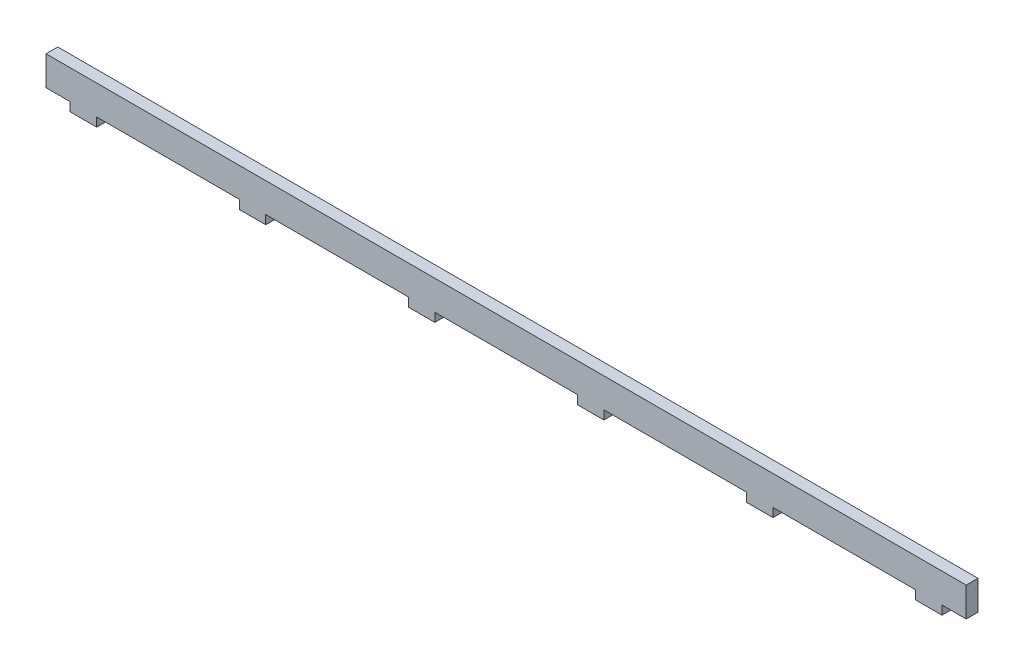
ISO-10303-21;
HEADER;
FILE_DESCRIPTION(('STEP AP214'),'2;1');
FILE_NAME('part.step','',(''),(''),'','','');
FILE_SCHEMA(('AUTOMOTIVE_DESIGN { 1 0 10303 214 1 1 1 1 }'));
ENDSEC;
DATA;
#1=APPLICATION_CONTEXT('core data for automotive mechanical design processes');
#2=APPLICATION_PROTOCOL_DEFINITION('international standard','automotive_design',2000,#1);
#3=PRODUCT_CONTEXT('',#1,'mechanical');
#4=PRODUCT('Part','Part','',(#3));
#5=PRODUCT_RELATED_PRODUCT_CATEGORY('part','',(#4));
#6=PRODUCT_DEFINITION_FORMATION('','',#4);
#7=PRODUCT_DEFINITION_CONTEXT('part definition',#1,'design');
#8=PRODUCT_DEFINITION('design','',#6,#7);
#9=PRODUCT_DEFINITION_SHAPE('','',#8);
#10=(LENGTH_UNIT() NAMED_UNIT(*) SI_UNIT(.MILLI.,.METRE.));
#11=(NAMED_UNIT(*) PLANE_ANGLE_UNIT() SI_UNIT($,.RADIAN.));
#12=(NAMED_UNIT(*) SI_UNIT($,.STERADIAN.) SOLID_ANGLE_UNIT());
#13=UNCERTAINTY_MEASURE_WITH_UNIT(LENGTH_MEASURE(1.E-05),#10,'distance_accuracy_value','');
#14=(GEOMETRIC_REPRESENTATION_CONTEXT(3) GLOBAL_UNCERTAINTY_ASSIGNED_CONTEXT((#13)) GLOBAL_UNIT_ASSIGNED_CONTEXT((#10,
#11,#12)) REPRESENTATION_CONTEXT('',''));
#15=CARTESIAN_POINT('',(0.,0.,0.));
#16=DIRECTION('',(0.,0.,1.));
#17=DIRECTION('',(1.,0.,0.));
#18=AXIS2_PLACEMENT_3D('',#15,#16,#17);
#19=CARTESIAN_POINT('',(-148.2634,-206.5,13.));
#20=DIRECTION('',(-1.,0.,0.));
#21=DIRECTION('',(0.,1.,0.));
#22=AXIS2_PLACEMENT_3D('',#19,#20,#21);
#23=PLANE('',#22);
#24=DIRECTION('',(0.,0.,1.));
#25=VECTOR('',#24,1.);
#26=CARTESIAN_POINT('',(-148.2634,-203.5,13.));
#27=LINE('',#26,#25);
#28=CARTESIAN_POINT('',(-148.2634,-203.5,8.99999999999999));
#29=VERTEX_POINT('',#28);
#30=CARTESIAN_POINT('',(-148.2634,-203.5,13.));
#31=VERTEX_POINT('',#30);
#32=EDGE_CURVE('E11',#29,#31,#27,.T.);
#33=ORIENTED_EDGE('',*,*,#32,.F.);
#34=DIRECTION('',(0.,1.,0.));
#35=VECTOR('',#34,1.);
#36=CARTESIAN_POINT('',(-148.2634,0.,8.99999999999999));
#37=LINE('',#36,#35);
#38=CARTESIAN_POINT('',(-148.2634,-206.5,8.99999999999999));
#39=VERTEX_POINT('',#38);
#40=EDGE_CURVE('E166',#39,#29,#37,.T.);
#41=ORIENTED_EDGE('',*,*,#40,.F.);
#42=DIRECTION('',(0.,0.,1.));
#43=VECTOR('',#42,1.);
#44=CARTESIAN_POINT('',(-148.2634,-206.5,13.));
#45=LINE('',#44,#43);
#46=CARTESIAN_POINT('',(-148.2634,-206.5,13.));
#47=VERTEX_POINT('',#46);
#48=EDGE_CURVE('E48',#39,#47,#45,.T.);
#49=ORIENTED_EDGE('',*,*,#48,.T.);
#50=DIRECTION('',(0.,1.,0.));
#51=VECTOR('',#50,1.);
#52=CARTESIAN_POINT('',(-148.2634,-206.5,13.));
#53=LINE('',#52,#51);
#54=EDGE_CURVE('E324',#47,#31,#53,.T.);
#55=ORIENTED_EDGE('',*,*,#54,.T.);
#56=EDGE_LOOP('',(#33,#41,#49,#55));
#57=FACE_BOUND('',#56,.T.);
#58=ADVANCED_FACE('F39',(#57),#23,.T.);
#59=CARTESIAN_POINT('',(-139.2634,-206.5,13.));
#60=DIRECTION('',(0.,-1.,0.));
#61=DIRECTION('',(-1.,0.,0.));
#62=AXIS2_PLACEMENT_3D('',#59,#60,#61);
#63=PLANE('',#62);
#64=ORIENTED_EDGE('',*,*,#48,.F.);
#65=DIRECTION('',(-1.,0.,0.));
#66=VECTOR('',#65,1.);
#67=CARTESIAN_POINT('',(0.,-206.5,8.99999999999999));
#68=LINE('',#67,#66);
#69=CARTESIAN_POINT('',(-139.2634,-206.5,8.99999999999999));
#70=VERTEX_POINT('',#69);
#71=EDGE_CURVE('E245',#70,#39,#68,.T.);
#72=ORIENTED_EDGE('',*,*,#71,.F.);
#73=DIRECTION('',(0.,0.,1.));
#74=VECTOR('',#73,1.);
#75=CARTESIAN_POINT('',(-139.2634,-206.5,13.));
#76=LINE('',#75,#74);
#77=CARTESIAN_POINT('',(-139.2634,-206.5,13.));
#78=VERTEX_POINT('',#77);
#79=EDGE_CURVE('E317',#70,#78,#76,.T.);
#80=ORIENTED_EDGE('',*,*,#79,.T.);
#81=DIRECTION('',(-1.,0.,0.));
#82=VECTOR('',#81,1.);
#83=CARTESIAN_POINT('',(-139.2634,-206.5,13.));
#84=LINE('',#83,#82);
#85=EDGE_CURVE('E334',#78,#47,#84,.T.);
#86=ORIENTED_EDGE('',*,*,#85,.T.);
#87=EDGE_LOOP('',(#64,#72,#80,#86));
#88=FACE_BOUND('',#87,.T.);
#89=ADVANCED_FACE('F337',(#88),#63,.T.);
#90=CARTESIAN_POINT('',(-139.2634,-206.5,13.));
#91=DIRECTION('',(-1.,0.,0.));
#92=DIRECTION('',(0.,1.,0.));
#93=AXIS2_PLACEMENT_3D('',#90,#91,#92);
#94=PLANE('',#93);
#95=ORIENTED_EDGE('',*,*,#79,.F.);
#96=DIRECTION('',(0.,1.,0.));
#97=VECTOR('',#96,1.);
#98=CARTESIAN_POINT('',(-139.2634,0.,8.99999999999999));
#99=LINE('',#98,#97);
#100=CARTESIAN_POINT('',(-139.2634,-203.5,8.99999999999999));
#101=VERTEX_POINT('',#100);
#102=EDGE_CURVE('E242',#70,#101,#99,.T.);
#103=ORIENTED_EDGE('',*,*,#102,.T.);
#104=DIRECTION('',(0.,0.,1.));
#105=VECTOR('',#104,1.);
#106=CARTESIAN_POINT('',(-139.2634,-203.5,13.));
#107=LINE('',#106,#105);
#108=CARTESIAN_POINT('',(-139.2634,-203.5,13.));
#109=VERTEX_POINT('',#108);
#110=EDGE_CURVE('E314',#101,#109,#107,.T.);
#111=ORIENTED_EDGE('',*,*,#110,.T.);
#112=DIRECTION('',(0.,1.,0.));
#113=VECTOR('',#112,1.);
#114=CARTESIAN_POINT('',(-139.2634,-206.5,13.));
#115=LINE('',#114,#113);
#116=EDGE_CURVE('E338',#78,#109,#115,.T.);
#117=ORIENTED_EDGE('',*,*,#116,.F.);
#118=EDGE_LOOP('',(#95,#103,#111,#117));
#119=FACE_BOUND('',#118,.T.);
#120=ADVANCED_FACE('F496',(#119),#94,.F.);
#121=CARTESIAN_POINT('',(-156.5,-203.5,13.));
#122=DIRECTION('',(0.,1.,0.));
#123=DIRECTION('',(1.,0.,0.));
#124=AXIS2_PLACEMENT_3D('',#121,#122,#123);
#125=PLANE('',#124);
#126=ORIENTED_EDGE('',*,*,#110,.F.);
#127=DIRECTION('',(-1.,0.,0.));
#128=VECTOR('',#127,1.);
#129=CARTESIAN_POINT('',(0.,-203.5,8.99999999999999));
#130=LINE('',#129,#128);
#131=CARTESIAN_POINT('',(-90.75804,-203.5,8.99999999999999));
#132=VERTEX_POINT('',#131);
#133=EDGE_CURVE('E239',#101,#132,#130,.F.);
#134=ORIENTED_EDGE('',*,*,#133,.T.);
#135=DIRECTION('',(0.,0.,1.));
#136=VECTOR('',#135,1.);
#137=CARTESIAN_POINT('',(-90.75804,-203.5,13.));
#138=LINE('',#137,#136);
#139=CARTESIAN_POINT('',(-90.75804,-203.5,13.));
#140=VERTEX_POINT('',#139);
#141=EDGE_CURVE('E311',#132,#140,#138,.T.);
#142=ORIENTED_EDGE('',*,*,#141,.T.);
#143=DIRECTION('',(1.,0.,0.));
#144=VECTOR('',#143,1.);
#145=CARTESIAN_POINT('',(-156.5,-203.5,13.));
#146=LINE('',#145,#144);
#147=EDGE_CURVE('E340',#109,#140,#146,.T.);
#148=ORIENTED_EDGE('',*,*,#147,.F.);
#149=EDGE_LOOP('',(#126,#134,#142,#148));
#150=FACE_BOUND('',#149,.T.);
#151=ADVANCED_FACE('F500',(#150),#125,.F.);
#152=CARTESIAN_POINT('',(-90.75804,-206.5,13.));
#153=DIRECTION('',(-1.,0.,0.));
#154=DIRECTION('',(0.,1.,0.));
#155=AXIS2_PLACEMENT_3D('',#152,#153,#154);
#156=PLANE('',#155);
#157=ORIENTED_EDGE('',*,*,#141,.F.);
#158=DIRECTION('',(0.,1.,0.));
#159=VECTOR('',#158,1.);
#160=CARTESIAN_POINT('',(-90.75804,0.,8.99999999999999));
#161=LINE('',#160,#159);
#162=CARTESIAN_POINT('',(-90.75804,-206.5,8.99999999999999));
#163=VERTEX_POINT('',#162);
#164=EDGE_CURVE('E236',#163,#132,#161,.T.);
#165=ORIENTED_EDGE('',*,*,#164,.F.);
#166=DIRECTION('',(0.,0.,1.));
#167=VECTOR('',#166,1.);
#168=CARTESIAN_POINT('',(-90.75804,-206.5,13.));
#169=LINE('',#168,#167);
#170=CARTESIAN_POINT('',(-90.75804,-206.5,13.));
#171=VERTEX_POINT('',#170);
#172=EDGE_CURVE('E308',#163,#171,#169,.T.);
#173=ORIENTED_EDGE('',*,*,#172,.T.);
#174=DIRECTION('',(0.,1.,0.));
#175=VECTOR('',#174,1.);
#176=CARTESIAN_POINT('',(-90.75804,-206.5,13.));
#177=LINE('',#176,#175);
#178=EDGE_CURVE('E344',#171,#140,#177,.T.);
#179=ORIENTED_EDGE('',*,*,#178,.T.);
#180=EDGE_LOOP('',(#157,#165,#173,#179));
#181=FACE_BOUND('',#180,.T.);
#182=ADVANCED_FACE('F503',(#181),#156,.T.);
#183=CARTESIAN_POINT('',(-81.75804,-206.5,13.));
#184=DIRECTION('',(0.,-1.,0.));
#185=DIRECTION('',(-1.,0.,0.));
#186=AXIS2_PLACEMENT_3D('',#183,#184,#185);
#187=PLANE('',#186);
#188=ORIENTED_EDGE('',*,*,#172,.F.);
#189=DIRECTION('',(-1.,0.,0.));
#190=VECTOR('',#189,1.);
#191=CARTESIAN_POINT('',(0.,-206.5,8.99999999999999));
#192=LINE('',#191,#190);
#193=CARTESIAN_POINT('',(-81.75804,-206.5,8.99999999999999));
#194=VERTEX_POINT('',#193);
#195=EDGE_CURVE('E233',#194,#163,#192,.T.);
#196=ORIENTED_EDGE('',*,*,#195,.F.);
#197=DIRECTION('',(0.,0.,1.));
#198=VECTOR('',#197,1.);
#199=CARTESIAN_POINT('',(-81.75804,-206.5,13.));
#200=LINE('',#199,#198);
#201=CARTESIAN_POINT('',(-81.75804,-206.5,13.));
#202=VERTEX_POINT('',#201);
#203=EDGE_CURVE('E305',#194,#202,#200,.T.);
#204=ORIENTED_EDGE('',*,*,#203,.T.);
#205=DIRECTION('',(-1.,0.,0.));
#206=VECTOR('',#205,1.);
#207=CARTESIAN_POINT('',(-81.75804,-206.5,13.));
#208=LINE('',#207,#206);
#209=EDGE_CURVE('E347',#202,#171,#208,.T.);
#210=ORIENTED_EDGE('',*,*,#209,.T.);
#211=EDGE_LOOP('',(#188,#196,#204,#210));
#212=FACE_BOUND('',#211,.T.);
#213=ADVANCED_FACE('F508',(#212),#187,.T.);
#214=CARTESIAN_POINT('',(-81.75804,-206.5,13.));
#215=DIRECTION('',(-1.,0.,0.));
#216=DIRECTION('',(0.,1.,0.));
#217=AXIS2_PLACEMENT_3D('',#214,#215,#216);
#218=PLANE('',#217);
#219=ORIENTED_EDGE('',*,*,#203,.F.);
#220=DIRECTION('',(0.,1.,0.));
#221=VECTOR('',#220,1.);
#222=CARTESIAN_POINT('',(-81.75804,0.,8.99999999999999));
#223=LINE('',#222,#221);
#224=CARTESIAN_POINT('',(-81.75804,-203.5,8.99999999999999));
#225=VERTEX_POINT('',#224);
#226=EDGE_CURVE('E230',#194,#225,#223,.T.);
#227=ORIENTED_EDGE('',*,*,#226,.T.);
#228=DIRECTION('',(0.,0.,1.));
#229=VECTOR('',#228,1.);
#230=CARTESIAN_POINT('',(-81.75804,-203.5,13.));
#231=LINE('',#230,#229);
#232=CARTESIAN_POINT('',(-81.75804,-203.5,13.));
#233=VERTEX_POINT('',#232);
#234=EDGE_CURVE('E302',#225,#233,#231,.T.);
#235=ORIENTED_EDGE('',*,*,#234,.T.);
#236=DIRECTION('',(0.,1.,0.));
#237=VECTOR('',#236,1.);
#238=CARTESIAN_POINT('',(-81.75804,-206.5,13.));
#239=LINE('',#238,#237);
#240=EDGE_CURVE('E350',#202,#233,#239,.T.);
#241=ORIENTED_EDGE('',*,*,#240,.F.);
#242=EDGE_LOOP('',(#219,#227,#235,#241));
#243=FACE_BOUND('',#242,.T.);
#244=ADVANCED_FACE('F512',(#243),#218,.F.);
#245=ORIENTED_EDGE('',*,*,#234,.F.);
#246=DIRECTION('',(-1.,0.,0.));
#247=VECTOR('',#246,1.);
#248=CARTESIAN_POINT('',(0.,-203.5,8.99999999999999));
#249=LINE('',#248,#247);
#250=CARTESIAN_POINT('',(-33.25268,-203.5,8.99999999999999));
#251=VERTEX_POINT('',#250);
#252=EDGE_CURVE('E227',#225,#251,#249,.F.);
#253=ORIENTED_EDGE('',*,*,#252,.T.);
#254=DIRECTION('',(0.,0.,1.));
#255=VECTOR('',#254,1.);
#256=CARTESIAN_POINT('',(-33.25268,-203.5,13.));
#257=LINE('',#256,#255);
#258=CARTESIAN_POINT('',(-33.25268,-203.5,13.));
#259=VERTEX_POINT('',#258);
#260=EDGE_CURVE('E299',#251,#259,#257,.T.);
#261=ORIENTED_EDGE('',*,*,#260,.T.);
#262=EDGE_CURVE('E353',#233,#259,#146,.T.);
#263=ORIENTED_EDGE('',*,*,#262,.F.);
#264=EDGE_LOOP('',(#245,#253,#261,#263));
#265=FACE_BOUND('',#264,.T.);
#266=ADVANCED_FACE('F514',(#265),#125,.F.);
#267=CARTESIAN_POINT('',(-33.25268,-206.5,13.));
#268=DIRECTION('',(-1.,0.,0.));
#269=DIRECTION('',(0.,1.,0.));
#270=AXIS2_PLACEMENT_3D('',#267,#268,#269);
#271=PLANE('',#270);
#272=ORIENTED_EDGE('',*,*,#260,.F.);
#273=DIRECTION('',(0.,1.,0.));
#274=VECTOR('',#273,1.);
#275=CARTESIAN_POINT('',(-33.25268,0.,8.99999999999999));
#276=LINE('',#275,#274);
#277=CARTESIAN_POINT('',(-33.25268,-206.5,8.99999999999999));
#278=VERTEX_POINT('',#277);
#279=EDGE_CURVE('E224',#278,#251,#276,.T.);
#280=ORIENTED_EDGE('',*,*,#279,.F.);
#281=DIRECTION('',(0.,0.,1.));
#282=VECTOR('',#281,1.);
#283=CARTESIAN_POINT('',(-33.25268,-206.5,13.));
#284=LINE('',#283,#282);
#285=CARTESIAN_POINT('',(-33.25268,-206.5,13.));
#286=VERTEX_POINT('',#285);
#287=EDGE_CURVE('E296',#278,#286,#284,.T.);
#288=ORIENTED_EDGE('',*,*,#287,.T.);
#289=DIRECTION('',(0.,1.,0.));
#290=VECTOR('',#289,1.);
#291=CARTESIAN_POINT('',(-33.25268,-206.5,13.));
#292=LINE('',#291,#290);
#293=EDGE_CURVE('E354',#286,#259,#292,.T.);
#294=ORIENTED_EDGE('',*,*,#293,.T.);
#295=EDGE_LOOP('',(#272,#280,#288,#294));
#296=FACE_BOUND('',#295,.T.);
#297=ADVANCED_FACE('F519',(#296),#271,.T.);
#298=CARTESIAN_POINT('',(-24.25268,-206.5,13.));
#299=DIRECTION('',(0.,-1.,0.));
#300=DIRECTION('',(-1.,0.,0.));
#301=AXIS2_PLACEMENT_3D('',#298,#299,#300);
#302=PLANE('',#301);
#303=ORIENTED_EDGE('',*,*,#287,.F.);
#304=DIRECTION('',(-1.,0.,0.));
#305=VECTOR('',#304,1.);
#306=CARTESIAN_POINT('',(0.,-206.5,8.99999999999999));
#307=LINE('',#306,#305);
#308=CARTESIAN_POINT('',(-24.25268,-206.5,8.99999999999999));
#309=VERTEX_POINT('',#308);
#310=EDGE_CURVE('E221',#309,#278,#307,.T.);
#311=ORIENTED_EDGE('',*,*,#310,.F.);
#312=DIRECTION('',(0.,0.,1.));
#313=VECTOR('',#312,1.);
#314=CARTESIAN_POINT('',(-24.25268,-206.5,13.));
#315=LINE('',#314,#313);
#316=CARTESIAN_POINT('',(-24.25268,-206.5,13.));
#317=VERTEX_POINT('',#316);
#318=EDGE_CURVE('E293',#309,#317,#315,.T.);
#319=ORIENTED_EDGE('',*,*,#318,.T.);
#320=DIRECTION('',(-1.,0.,0.));
#321=VECTOR('',#320,1.);
#322=CARTESIAN_POINT('',(-24.25268,-206.5,13.));
#323=LINE('',#322,#321);
#324=EDGE_CURVE('E357',#317,#286,#323,.T.);
#325=ORIENTED_EDGE('',*,*,#324,.T.);
#326=EDGE_LOOP('',(#303,#311,#319,#325));
#327=FACE_BOUND('',#326,.T.);
#328=ADVANCED_FACE('F523',(#327),#302,.T.);
#329=CARTESIAN_POINT('',(-24.25268,-206.5,13.));
#330=DIRECTION('',(-1.,0.,0.));
#331=DIRECTION('',(0.,1.,0.));
#332=AXIS2_PLACEMENT_3D('',#329,#330,#331);
#333=PLANE('',#332);
#334=ORIENTED_EDGE('',*,*,#318,.F.);
#335=DIRECTION('',(0.,1.,0.));
#336=VECTOR('',#335,1.);
#337=CARTESIAN_POINT('',(-24.25268,0.,8.99999999999999));
#338=LINE('',#337,#336);
#339=CARTESIAN_POINT('',(-24.25268,-203.5,8.99999999999999));
#340=VERTEX_POINT('',#339);
#341=EDGE_CURVE('E218',#309,#340,#338,.T.);
#342=ORIENTED_EDGE('',*,*,#341,.T.);
#343=DIRECTION('',(0.,0.,1.));
#344=VECTOR('',#343,1.);
#345=CARTESIAN_POINT('',(-24.25268,-203.5,13.));
#346=LINE('',#345,#344);
#347=CARTESIAN_POINT('',(-24.25268,-203.5,13.));
#348=VERTEX_POINT('',#347);
#349=EDGE_CURVE('E290',#340,#348,#346,.T.);
#350=ORIENTED_EDGE('',*,*,#349,.T.);
#351=DIRECTION('',(0.,1.,0.));
#352=VECTOR('',#351,1.);
#353=CARTESIAN_POINT('',(-24.25268,-206.5,13.));
#354=LINE('',#353,#352);
#355=EDGE_CURVE('E360',#317,#348,#354,.T.);
#356=ORIENTED_EDGE('',*,*,#355,.F.);
#357=EDGE_LOOP('',(#334,#342,#350,#356));
#358=FACE_BOUND('',#357,.T.);
#359=ADVANCED_FACE('F525',(#358),#333,.F.);
#360=ORIENTED_EDGE('',*,*,#349,.F.);
#361=DIRECTION('',(-1.,0.,0.));
#362=VECTOR('',#361,1.);
#363=CARTESIAN_POINT('',(0.,-203.5,8.99999999999999));
#364=LINE('',#363,#362);
#365=CARTESIAN_POINT('',(24.25268,-203.5,8.99999999999999));
#366=VERTEX_POINT('',#365);
#367=EDGE_CURVE('E215',#340,#366,#364,.F.);
#368=ORIENTED_EDGE('',*,*,#367,.T.);
#369=DIRECTION('',(0.,0.,1.));
#370=VECTOR('',#369,1.);
#371=CARTESIAN_POINT('',(24.25268,-203.5,13.));
#372=LINE('',#371,#370);
#373=CARTESIAN_POINT('',(24.25268,-203.5,13.));
#374=VERTEX_POINT('',#373);
#375=EDGE_CURVE('E287',#366,#374,#372,.T.);
#376=ORIENTED_EDGE('',*,*,#375,.T.);
#377=EDGE_CURVE('E363',#348,#374,#146,.T.);
#378=ORIENTED_EDGE('',*,*,#377,.F.);
#379=EDGE_LOOP('',(#360,#368,#376,#378));
#380=FACE_BOUND('',#379,.T.);
#381=ADVANCED_FACE('F529',(#380),#125,.F.);
#382=CARTESIAN_POINT('',(24.25268,-206.5,13.));
#383=DIRECTION('',(-1.,0.,0.));
#384=DIRECTION('',(0.,1.,0.));
#385=AXIS2_PLACEMENT_3D('',#382,#383,#384);
#386=PLANE('',#385);
#387=ORIENTED_EDGE('',*,*,#375,.F.);
#388=DIRECTION('',(0.,1.,0.));
#389=VECTOR('',#388,1.);
#390=CARTESIAN_POINT('',(24.25268,0.,8.99999999999999));
#391=LINE('',#390,#389);
#392=CARTESIAN_POINT('',(24.25268,-206.5,8.99999999999999));
#393=VERTEX_POINT('',#392);
#394=EDGE_CURVE('E212',#393,#366,#391,.T.);
#395=ORIENTED_EDGE('',*,*,#394,.F.);
#396=DIRECTION('',(0.,0.,1.));
#397=VECTOR('',#396,1.);
#398=CARTESIAN_POINT('',(24.25268,-206.5,13.));
#399=LINE('',#398,#397);
#400=CARTESIAN_POINT('',(24.25268,-206.5,13.));
#401=VERTEX_POINT('',#400);
#402=EDGE_CURVE('E284',#393,#401,#399,.T.);
#403=ORIENTED_EDGE('',*,*,#402,.T.);
#404=DIRECTION('',(0.,1.,0.));
#405=VECTOR('',#404,1.);
#406=CARTESIAN_POINT('',(24.25268,-206.5,13.));
#407=LINE('',#406,#405);
#408=EDGE_CURVE('E364',#401,#374,#407,.T.);
#409=ORIENTED_EDGE('',*,*,#408,.T.);
#410=EDGE_LOOP('',(#387,#395,#403,#409));
#411=FACE_BOUND('',#410,.T.);
#412=ADVANCED_FACE('F531',(#411),#386,.T.);
#413=CARTESIAN_POINT('',(33.25268,-206.5,13.));
#414=DIRECTION('',(0.,-1.,0.));
#415=DIRECTION('',(-1.,0.,0.));
#416=AXIS2_PLACEMENT_3D('',#413,#414,#415);
#417=PLANE('',#416);
#418=ORIENTED_EDGE('',*,*,#402,.F.);
#419=DIRECTION('',(-1.,0.,0.));
#420=VECTOR('',#419,1.);
#421=CARTESIAN_POINT('',(0.,-206.5,8.99999999999999));
#422=LINE('',#421,#420);
#423=CARTESIAN_POINT('',(33.25268,-206.5,8.99999999999999));
#424=VERTEX_POINT('',#423);
#425=EDGE_CURVE('E209',#424,#393,#422,.T.);
#426=ORIENTED_EDGE('',*,*,#425,.F.);
#427=DIRECTION('',(0.,0.,1.));
#428=VECTOR('',#427,1.);
#429=CARTESIAN_POINT('',(33.25268,-206.5,13.));
#430=LINE('',#429,#428);
#431=CARTESIAN_POINT('',(33.25268,-206.5,13.));
#432=VERTEX_POINT('',#431);
#433=EDGE_CURVE('E281',#424,#432,#430,.T.);
#434=ORIENTED_EDGE('',*,*,#433,.T.);
#435=DIRECTION('',(-1.,0.,0.));
#436=VECTOR('',#435,1.);
#437=CARTESIAN_POINT('',(33.25268,-206.5,13.));
#438=LINE('',#437,#436);
#439=EDGE_CURVE('E367',#432,#401,#438,.T.);
#440=ORIENTED_EDGE('',*,*,#439,.T.);
#441=EDGE_LOOP('',(#418,#426,#434,#440));
#442=FACE_BOUND('',#441,.T.);
#443=ADVANCED_FACE('F533',(#442),#417,.T.);
#444=CARTESIAN_POINT('',(33.25268,-206.5,13.));
#445=DIRECTION('',(-1.,0.,0.));
#446=DIRECTION('',(0.,1.,0.));
#447=AXIS2_PLACEMENT_3D('',#444,#445,#446);
#448=PLANE('',#447);
#449=ORIENTED_EDGE('',*,*,#433,.F.);
#450=DIRECTION('',(0.,1.,0.));
#451=VECTOR('',#450,1.);
#452=CARTESIAN_POINT('',(33.25268,0.,8.99999999999999));
#453=LINE('',#452,#451);
#454=CARTESIAN_POINT('',(33.25268,-203.5,8.99999999999999));
#455=VERTEX_POINT('',#454);
#456=EDGE_CURVE('E206',#424,#455,#453,.T.);
#457=ORIENTED_EDGE('',*,*,#456,.T.);
#458=DIRECTION('',(0.,0.,1.));
#459=VECTOR('',#458,1.);
#460=CARTESIAN_POINT('',(33.25268,-203.5,13.));
#461=LINE('',#460,#459);
#462=CARTESIAN_POINT('',(33.25268,-203.5,13.));
#463=VERTEX_POINT('',#462);
#464=EDGE_CURVE('E278',#455,#463,#461,.T.);
#465=ORIENTED_EDGE('',*,*,#464,.T.);
#466=DIRECTION('',(0.,1.,0.));
#467=VECTOR('',#466,1.);
#468=CARTESIAN_POINT('',(33.25268,-206.5,13.));
#469=LINE('',#468,#467);
#470=EDGE_CURVE('E370',#432,#463,#469,.T.);
#471=ORIENTED_EDGE('',*,*,#470,.F.);
#472=EDGE_LOOP('',(#449,#457,#465,#471));
#473=FACE_BOUND('',#472,.T.);
#474=ADVANCED_FACE('F537',(#473),#448,.F.);
#475=ORIENTED_EDGE('',*,*,#464,.F.);
#476=DIRECTION('',(-1.,0.,0.));
#477=VECTOR('',#476,1.);
#478=CARTESIAN_POINT('',(0.,-203.5,8.99999999999999));
#479=LINE('',#478,#477);
#480=CARTESIAN_POINT('',(81.75804,-203.5,8.99999999999999));
#481=VERTEX_POINT('',#480);
#482=EDGE_CURVE('E203',#455,#481,#479,.F.);
#483=ORIENTED_EDGE('',*,*,#482,.T.);
#484=DIRECTION('',(0.,0.,1.));
#485=VECTOR('',#484,1.);
#486=CARTESIAN_POINT('',(81.75804,-203.5,13.));
#487=LINE('',#486,#485);
#488=CARTESIAN_POINT('',(81.75804,-203.5,13.));
#489=VERTEX_POINT('',#488);
#490=EDGE_CURVE('E275',#481,#489,#487,.T.);
#491=ORIENTED_EDGE('',*,*,#490,.T.);
#492=EDGE_CURVE('E373',#463,#489,#146,.T.);
#493=ORIENTED_EDGE('',*,*,#492,.F.);
#494=EDGE_LOOP('',(#475,#483,#491,#493));
#495=FACE_BOUND('',#494,.T.);
#496=ADVANCED_FACE('F538',(#495),#125,.F.);
#497=CARTESIAN_POINT('',(81.75804,-206.5,13.));
#498=DIRECTION('',(-1.,0.,0.));
#499=DIRECTION('',(0.,1.,0.));
#500=AXIS2_PLACEMENT_3D('',#497,#498,#499);
#501=PLANE('',#500);
#502=ORIENTED_EDGE('',*,*,#490,.F.);
#503=DIRECTION('',(0.,1.,0.));
#504=VECTOR('',#503,1.);
#505=CARTESIAN_POINT('',(81.75804,0.,8.99999999999999));
#506=LINE('',#505,#504);
#507=CARTESIAN_POINT('',(81.75804,-206.5,8.99999999999999));
#508=VERTEX_POINT('',#507);
#509=EDGE_CURVE('E200',#508,#481,#506,.T.);
#510=ORIENTED_EDGE('',*,*,#509,.F.);
#511=DIRECTION('',(0.,0.,1.));
#512=VECTOR('',#511,1.);
#513=CARTESIAN_POINT('',(81.75804,-206.5,13.));
#514=LINE('',#513,#512);
#515=CARTESIAN_POINT('',(81.75804,-206.5,13.));
#516=VERTEX_POINT('',#515);
#517=EDGE_CURVE('E272',#508,#516,#514,.T.);
#518=ORIENTED_EDGE('',*,*,#517,.T.);
#519=DIRECTION('',(0.,1.,0.));
#520=VECTOR('',#519,1.);
#521=CARTESIAN_POINT('',(81.75804,-206.5,13.));
#522=LINE('',#521,#520);
#523=EDGE_CURVE('E374',#516,#489,#522,.T.);
#524=ORIENTED_EDGE('',*,*,#523,.T.);
#525=EDGE_LOOP('',(#502,#510,#518,#524));
#526=FACE_BOUND('',#525,.T.);
#527=ADVANCED_FACE('F425',(#526),#501,.T.);
#528=CARTESIAN_POINT('',(90.75804,-206.5,13.));
#529=DIRECTION('',(0.,-1.,0.));
#530=DIRECTION('',(-1.,0.,0.));
#531=AXIS2_PLACEMENT_3D('',#528,#529,#530);
#532=PLANE('',#531);
#533=ORIENTED_EDGE('',*,*,#517,.F.);
#534=DIRECTION('',(-1.,0.,0.));
#535=VECTOR('',#534,1.);
#536=CARTESIAN_POINT('',(0.,-206.5,8.99999999999999));
#537=LINE('',#536,#535);
#538=CARTESIAN_POINT('',(90.75804,-206.5,8.99999999999999));
#539=VERTEX_POINT('',#538);
#540=EDGE_CURVE('E197',#539,#508,#537,.T.);
#541=ORIENTED_EDGE('',*,*,#540,.F.);
#542=DIRECTION('',(0.,0.,1.));
#543=VECTOR('',#542,1.);
#544=CARTESIAN_POINT('',(90.75804,-206.5,13.));
#545=LINE('',#544,#543);
#546=CARTESIAN_POINT('',(90.75804,-206.5,13.));
#547=VERTEX_POINT('',#546);
#548=EDGE_CURVE('E269',#539,#547,#545,.T.);
#549=ORIENTED_EDGE('',*,*,#548,.T.);
#550=DIRECTION('',(-1.,0.,0.));
#551=VECTOR('',#550,1.);
#552=CARTESIAN_POINT('',(90.75804,-206.5,13.));
#553=LINE('',#552,#551);
#554=EDGE_CURVE('E377',#547,#516,#553,.T.);
#555=ORIENTED_EDGE('',*,*,#554,.T.);
#556=EDGE_LOOP('',(#533,#541,#549,#555));
#557=FACE_BOUND('',#556,.T.);
#558=ADVANCED_FACE('F431',(#557),#532,.T.);
#559=CARTESIAN_POINT('',(90.75804,-206.5,13.));
#560=DIRECTION('',(-1.,0.,0.));
#561=DIRECTION('',(0.,1.,0.));
#562=AXIS2_PLACEMENT_3D('',#559,#560,#561);
#563=PLANE('',#562);
#564=ORIENTED_EDGE('',*,*,#548,.F.);
#565=DIRECTION('',(0.,1.,0.));
#566=VECTOR('',#565,1.);
#567=CARTESIAN_POINT('',(90.75804,0.,8.99999999999999));
#568=LINE('',#567,#566);
#569=CARTESIAN_POINT('',(90.75804,-203.5,8.99999999999999));
#570=VERTEX_POINT('',#569);
#571=EDGE_CURVE('E194',#539,#570,#568,.T.);
#572=ORIENTED_EDGE('',*,*,#571,.T.);
#573=DIRECTION('',(0.,0.,1.));
#574=VECTOR('',#573,1.);
#575=CARTESIAN_POINT('',(90.75804,-203.5,13.));
#576=LINE('',#575,#574);
#577=CARTESIAN_POINT('',(90.75804,-203.5,13.));
#578=VERTEX_POINT('',#577);
#579=EDGE_CURVE('E266',#570,#578,#576,.T.);
#580=ORIENTED_EDGE('',*,*,#579,.T.);
#581=DIRECTION('',(0.,1.,0.));
#582=VECTOR('',#581,1.);
#583=CARTESIAN_POINT('',(90.75804,-206.5,13.));
#584=LINE('',#583,#582);
#585=EDGE_CURVE('E380',#547,#578,#584,.T.);
#586=ORIENTED_EDGE('',*,*,#585,.F.);
#587=EDGE_LOOP('',(#564,#572,#580,#586));
#588=FACE_BOUND('',#587,.T.);
#589=ADVANCED_FACE('F436',(#588),#563,.F.);
#590=ORIENTED_EDGE('',*,*,#579,.F.);
#591=DIRECTION('',(-1.,0.,0.));
#592=VECTOR('',#591,1.);
#593=CARTESIAN_POINT('',(0.,-203.5,8.99999999999999));
#594=LINE('',#593,#592);
#595=CARTESIAN_POINT('',(139.2634,-203.5,8.99999999999999));
#596=VERTEX_POINT('',#595);
#597=EDGE_CURVE('E191',#570,#596,#594,.F.);
#598=ORIENTED_EDGE('',*,*,#597,.T.);
#599=DIRECTION('',(0.,0.,1.));
#600=VECTOR('',#599,1.);
#601=CARTESIAN_POINT('',(139.2634,-203.5,13.));
#602=LINE('',#601,#600);
#603=CARTESIAN_POINT('',(139.2634,-203.5,13.));
#604=VERTEX_POINT('',#603);
#605=EDGE_CURVE('E263',#596,#604,#602,.T.);
#606=ORIENTED_EDGE('',*,*,#605,.T.);
#607=EDGE_CURVE('E383',#578,#604,#146,.T.);
#608=ORIENTED_EDGE('',*,*,#607,.F.);
#609=EDGE_LOOP('',(#590,#598,#606,#608));
#610=FACE_BOUND('',#609,.T.);
#611=ADVANCED_FACE('F445',(#610),#125,.F.);
#612=CARTESIAN_POINT('',(139.2634,-206.5,13.));
#613=DIRECTION('',(-1.,0.,0.));
#614=DIRECTION('',(0.,1.,0.));
#615=AXIS2_PLACEMENT_3D('',#612,#613,#614);
#616=PLANE('',#615);
#617=ORIENTED_EDGE('',*,*,#605,.F.);
#618=DIRECTION('',(0.,1.,0.));
#619=VECTOR('',#618,1.);
#620=CARTESIAN_POINT('',(139.2634,0.,8.99999999999999));
#621=LINE('',#620,#619);
#622=CARTESIAN_POINT('',(139.2634,-206.5,8.99999999999999));
#623=VERTEX_POINT('',#622);
#624=EDGE_CURVE('E188',#623,#596,#621,.T.);
#625=ORIENTED_EDGE('',*,*,#624,.F.);
#626=DIRECTION('',(0.,0.,1.));
#627=VECTOR('',#626,1.);
#628=CARTESIAN_POINT('',(139.2634,-206.5,13.));
#629=LINE('',#628,#627);
#630=CARTESIAN_POINT('',(139.2634,-206.5,13.));
#631=VERTEX_POINT('',#630);
#632=EDGE_CURVE('E260',#623,#631,#629,.T.);
#633=ORIENTED_EDGE('',*,*,#632,.T.);
#634=DIRECTION('',(0.,1.,0.));
#635=VECTOR('',#634,1.);
#636=CARTESIAN_POINT('',(139.2634,-206.5,13.));
#637=LINE('',#636,#635);
#638=EDGE_CURVE('E384',#631,#604,#637,.T.);
#639=ORIENTED_EDGE('',*,*,#638,.T.);
#640=EDGE_LOOP('',(#617,#625,#633,#639));
#641=FACE_BOUND('',#640,.T.);
#642=ADVANCED_FACE('F450',(#641),#616,.T.);
#643=CARTESIAN_POINT('',(148.2634,-206.5,13.));
#644=DIRECTION('',(0.,-1.,0.));
#645=DIRECTION('',(-1.,0.,0.));
#646=AXIS2_PLACEMENT_3D('',#643,#644,#645);
#647=PLANE('',#646);
#648=ORIENTED_EDGE('',*,*,#632,.F.);
#649=DIRECTION('',(-1.,0.,0.));
#650=VECTOR('',#649,1.);
#651=CARTESIAN_POINT('',(0.,-206.5,8.99999999999999));
#652=LINE('',#651,#650);
#653=CARTESIAN_POINT('',(148.2634,-206.5,8.99999999999999));
#654=VERTEX_POINT('',#653);
#655=EDGE_CURVE('E185',#654,#623,#652,.T.);
#656=ORIENTED_EDGE('',*,*,#655,.F.);
#657=DIRECTION('',(0.,0.,1.));
#658=VECTOR('',#657,1.);
#659=CARTESIAN_POINT('',(148.2634,-206.5,13.));
#660=LINE('',#659,#658);
#661=CARTESIAN_POINT('',(148.2634,-206.5,13.));
#662=VERTEX_POINT('',#661);
#663=EDGE_CURVE('E257',#654,#662,#660,.T.);
#664=ORIENTED_EDGE('',*,*,#663,.T.);
#665=DIRECTION('',(-1.,0.,0.));
#666=VECTOR('',#665,1.);
#667=CARTESIAN_POINT('',(148.2634,-206.5,13.));
#668=LINE('',#667,#666);
#669=EDGE_CURVE('E387',#662,#631,#668,.T.);
#670=ORIENTED_EDGE('',*,*,#669,.T.);
#671=EDGE_LOOP('',(#648,#656,#664,#670));
#672=FACE_BOUND('',#671,.T.);
#673=ADVANCED_FACE('F455',(#672),#647,.T.);
#674=CARTESIAN_POINT('',(148.2634,-206.5,13.));
#675=DIRECTION('',(-1.,0.,0.));
#676=DIRECTION('',(0.,1.,0.));
#677=AXIS2_PLACEMENT_3D('',#674,#675,#676);
#678=PLANE('',#677);
#679=ORIENTED_EDGE('',*,*,#663,.F.);
#680=DIRECTION('',(0.,1.,0.));
#681=VECTOR('',#680,1.);
#682=CARTESIAN_POINT('',(148.2634,0.,8.99999999999999));
#683=LINE('',#682,#681);
#684=CARTESIAN_POINT('',(148.2634,-203.5,8.99999999999999));
#685=VERTEX_POINT('',#684);
#686=EDGE_CURVE('E182',#654,#685,#683,.T.);
#687=ORIENTED_EDGE('',*,*,#686,.T.);
#688=DIRECTION('',(0.,0.,1.));
#689=VECTOR('',#688,1.);
#690=CARTESIAN_POINT('',(148.2634,-203.5,13.));
#691=LINE('',#690,#689);
#692=CARTESIAN_POINT('',(148.2634,-203.5,13.));
#693=VERTEX_POINT('',#692);
#694=EDGE_CURVE('E254',#685,#693,#691,.T.);
#695=ORIENTED_EDGE('',*,*,#694,.T.);
#696=DIRECTION('',(0.,1.,0.));
#697=VECTOR('',#696,1.);
#698=CARTESIAN_POINT('',(148.2634,-206.5,13.));
#699=LINE('',#698,#697);
#700=EDGE_CURVE('E390',#662,#693,#699,.T.);
#701=ORIENTED_EDGE('',*,*,#700,.F.);
#702=EDGE_LOOP('',(#679,#687,#695,#701));
#703=FACE_BOUND('',#702,.T.);
#704=ADVANCED_FACE('F463',(#703),#678,.F.);
#705=ORIENTED_EDGE('',*,*,#694,.F.);
#706=DIRECTION('',(-1.,0.,0.));
#707=VECTOR('',#706,1.);
#708=CARTESIAN_POINT('',(0.,-203.5,8.99999999999999));
#709=LINE('',#708,#707);
#710=CARTESIAN_POINT('',(156.5,-203.5,8.99999999999999));
#711=VERTEX_POINT('',#710);
#712=EDGE_CURVE('E179',#685,#711,#709,.F.);
#713=ORIENTED_EDGE('',*,*,#712,.T.);
#714=DIRECTION('',(0.,0.,1.));
#715=VECTOR('',#714,1.);
#716=CARTESIAN_POINT('',(156.5,-203.5,13.));
#717=LINE('',#716,#715);
#718=CARTESIAN_POINT('',(156.5,-203.5,13.));
#719=VERTEX_POINT('',#718);
#720=EDGE_CURVE('E251',#711,#719,#717,.T.);
#721=ORIENTED_EDGE('',*,*,#720,.T.);
#722=EDGE_CURVE('E392',#693,#719,#146,.T.);
#723=ORIENTED_EDGE('',*,*,#722,.F.);
#724=EDGE_LOOP('',(#705,#713,#721,#723));
#725=FACE_BOUND('',#724,.T.);
#726=ADVANCED_FACE('F466',(#725),#125,.F.);
#727=CARTESIAN_POINT('',(156.5,-203.5,13.));
#728=DIRECTION('',(-1.,0.,0.));
#729=DIRECTION('',(0.,1.,0.));
#730=AXIS2_PLACEMENT_3D('',#727,#728,#729);
#731=PLANE('',#730);
#732=ORIENTED_EDGE('',*,*,#720,.F.);
#733=DIRECTION('',(0.,1.,0.));
#734=VECTOR('',#733,1.);
#735=CARTESIAN_POINT('',(156.5,0.,8.99999999999999));
#736=LINE('',#735,#734);
#737=CARTESIAN_POINT('',(156.5,-193.5,8.99999999999999));
#738=VERTEX_POINT('',#737);
#739=EDGE_CURVE('E176',#711,#738,#736,.T.);
#740=ORIENTED_EDGE('',*,*,#739,.T.);
#741=DIRECTION('',(0.,0.,1.));
#742=VECTOR('',#741,1.);
#743=CARTESIAN_POINT('',(156.5,-193.5,13.));
#744=LINE('',#743,#742);
#745=CARTESIAN_POINT('',(156.5,-193.5,13.));
#746=VERTEX_POINT('',#745);
#747=EDGE_CURVE('E249',#738,#746,#744,.T.);
#748=ORIENTED_EDGE('',*,*,#747,.T.);
#749=DIRECTION('',(0.,1.,0.));
#750=VECTOR('',#749,1.);
#751=CARTESIAN_POINT('',(156.5,-203.5,13.));
#752=LINE('',#751,#750);
#753=EDGE_CURVE('E393',#719,#746,#752,.T.);
#754=ORIENTED_EDGE('',*,*,#753,.F.);
#755=EDGE_LOOP('',(#732,#740,#748,#754));
#756=FACE_BOUND('',#755,.T.);
#757=ADVANCED_FACE('F469',(#756),#731,.F.);
#758=CARTESIAN_POINT('',(-156.5,-193.5,13.));
#759=DIRECTION('',(0.,-1.,0.));
#760=DIRECTION('',(-1.,0.,0.));
#761=AXIS2_PLACEMENT_3D('',#758,#759,#760);
#762=PLANE('',#761);
#763=ORIENTED_EDGE('',*,*,#747,.F.);
#764=DIRECTION('',(-1.,0.,0.));
#765=VECTOR('',#764,1.);
#766=CARTESIAN_POINT('',(0.,-193.5,8.99999999999999));
#767=LINE('',#766,#765);
#768=CARTESIAN_POINT('',(-156.5,-193.5,8.99999999999999));
#769=VERTEX_POINT('',#768);
#770=EDGE_CURVE('E173',#738,#769,#767,.T.);
#771=ORIENTED_EDGE('',*,*,#770,.T.);
#772=DIRECTION('',(0.,0.,1.));
#773=VECTOR('',#772,1.);
#774=CARTESIAN_POINT('',(-156.5,-193.5,13.));
#775=LINE('',#774,#773);
#776=CARTESIAN_POINT('',(-156.5,-193.5,13.));
#777=VERTEX_POINT('',#776);
#778=EDGE_CURVE('E56',#769,#777,#775,.T.);
#779=ORIENTED_EDGE('',*,*,#778,.T.);
#780=DIRECTION('',(-1.,0.,0.));
#781=VECTOR('',#780,1.);
#782=CARTESIAN_POINT('',(-156.5,-193.5,13.));
#783=LINE('',#782,#781);
#784=EDGE_CURVE('E159',#746,#777,#783,.T.);
#785=ORIENTED_EDGE('',*,*,#784,.F.);
#786=EDGE_LOOP('',(#763,#771,#779,#785));
#787=FACE_BOUND('',#786,.T.);
#788=ADVANCED_FACE('F590',(#787),#762,.F.);
#789=CARTESIAN_POINT('',(-156.5,-203.5,13.));
#790=DIRECTION('',(1.,0.,0.));
#791=DIRECTION('',(0.,-1.,0.));
#792=AXIS2_PLACEMENT_3D('',#789,#790,#791);
#793=PLANE('',#792);
#794=ORIENTED_EDGE('',*,*,#778,.F.);
#795=DIRECTION('',(0.,1.,0.));
#796=VECTOR('',#795,1.);
#797=CARTESIAN_POINT('',(-156.5,0.,8.99999999999999));
#798=LINE('',#797,#796);
#799=CARTESIAN_POINT('',(-156.5,-203.5,8.99999999999999));
#800=VERTEX_POINT('',#799);
#801=EDGE_CURVE('E164',#769,#800,#798,.F.);
#802=ORIENTED_EDGE('',*,*,#801,.T.);
#803=DIRECTION('',(0.,0.,1.));
#804=VECTOR('',#803,1.);
#805=CARTESIAN_POINT('',(-156.5,-203.5,13.));
#806=LINE('',#805,#804);
#807=CARTESIAN_POINT('',(-156.5,-203.5,13.));
#808=VERTEX_POINT('',#807);
#809=EDGE_CURVE('E42',#800,#808,#806,.T.);
#810=ORIENTED_EDGE('',*,*,#809,.T.);
#811=DIRECTION('',(0.,-1.,0.));
#812=VECTOR('',#811,1.);
#813=CARTESIAN_POINT('',(-156.5,-203.5,13.));
#814=LINE('',#813,#812);
#815=EDGE_CURVE('E175',#777,#808,#814,.T.);
#816=ORIENTED_EDGE('',*,*,#815,.F.);
#817=EDGE_LOOP('',(#794,#802,#810,#816));
#818=FACE_BOUND('',#817,.T.);
#819=ADVANCED_FACE('F168',(#818),#793,.F.);
#820=DIRECTION('',(-1.,0.,0.));
#821=VECTOR('',#820,1.);
#822=CARTESIAN_POINT('',(0.,-203.5,8.99999999999999));
#823=LINE('',#822,#821);
#824=EDGE_CURVE('E153',#800,#29,#823,.F.);
#825=ORIENTED_EDGE('',*,*,#824,.T.);
#826=ORIENTED_EDGE('',*,*,#32,.T.);
#827=EDGE_CURVE('E155',#808,#31,#146,.T.);
#828=ORIENTED_EDGE('',*,*,#827,.F.);
#829=ORIENTED_EDGE('',*,*,#809,.F.);
#830=EDGE_LOOP('',(#825,#826,#828,#829));
#831=FACE_BOUND('',#830,.T.);
#832=ADVANCED_FACE('F152',(#831),#125,.F.);
#833=CARTESIAN_POINT('',(0.,0.,13.));
#834=DIRECTION('',(0.,0.,-1.));
#835=DIRECTION('',(-1.,0.,0.));
#836=AXIS2_PLACEMENT_3D('',#833,#834,#835);
#837=PLANE('',#836);
#838=ORIENTED_EDGE('',*,*,#815,.T.);
#839=ORIENTED_EDGE('',*,*,#827,.T.);
#840=ORIENTED_EDGE('',*,*,#54,.F.);
#841=ORIENTED_EDGE('',*,*,#85,.F.);
#842=ORIENTED_EDGE('',*,*,#116,.T.);
#843=ORIENTED_EDGE('',*,*,#147,.T.);
#844=ORIENTED_EDGE('',*,*,#178,.F.);
#845=ORIENTED_EDGE('',*,*,#209,.F.);
#846=ORIENTED_EDGE('',*,*,#240,.T.);
#847=ORIENTED_EDGE('',*,*,#262,.T.);
#848=ORIENTED_EDGE('',*,*,#293,.F.);
#849=ORIENTED_EDGE('',*,*,#324,.F.);
#850=ORIENTED_EDGE('',*,*,#355,.T.);
#851=ORIENTED_EDGE('',*,*,#377,.T.);
#852=ORIENTED_EDGE('',*,*,#408,.F.);
#853=ORIENTED_EDGE('',*,*,#439,.F.);
#854=ORIENTED_EDGE('',*,*,#470,.T.);
#855=ORIENTED_EDGE('',*,*,#492,.T.);
#856=ORIENTED_EDGE('',*,*,#523,.F.);
#857=ORIENTED_EDGE('',*,*,#554,.F.);
#858=ORIENTED_EDGE('',*,*,#585,.T.);
#859=ORIENTED_EDGE('',*,*,#607,.T.);
#860=ORIENTED_EDGE('',*,*,#638,.F.);
#861=ORIENTED_EDGE('',*,*,#669,.F.);
#862=ORIENTED_EDGE('',*,*,#700,.T.);
#863=ORIENTED_EDGE('',*,*,#722,.T.);
#864=ORIENTED_EDGE('',*,*,#753,.T.);
#865=ORIENTED_EDGE('',*,*,#784,.T.);
#866=EDGE_LOOP('',(#838,#839,#840,#841,#842,#843,#844,#845,#846,#847,#848,#849,#850,#851,#852,
#853,#854,#855,#856,#857,#858,#859,#860,#861,#862,#863,#864,#865));
#867=FACE_BOUND('',#866,.T.);
#868=ADVANCED_FACE('F332',(#867),#837,.F.);
#869=CARTESIAN_POINT('',(0.,0.,8.99999999999999));
#870=DIRECTION('',(0.,0.,-1.));
#871=DIRECTION('',(-1.,0.,0.));
#872=AXIS2_PLACEMENT_3D('',#869,#870,#871);
#873=PLANE('',#872);
#874=ORIENTED_EDGE('',*,*,#801,.F.);
#875=ORIENTED_EDGE('',*,*,#770,.F.);
#876=ORIENTED_EDGE('',*,*,#739,.F.);
#877=ORIENTED_EDGE('',*,*,#712,.F.);
#878=ORIENTED_EDGE('',*,*,#686,.F.);
#879=ORIENTED_EDGE('',*,*,#655,.T.);
#880=ORIENTED_EDGE('',*,*,#624,.T.);
#881=ORIENTED_EDGE('',*,*,#597,.F.);
#882=ORIENTED_EDGE('',*,*,#571,.F.);
#883=ORIENTED_EDGE('',*,*,#540,.T.);
#884=ORIENTED_EDGE('',*,*,#509,.T.);
#885=ORIENTED_EDGE('',*,*,#482,.F.);
#886=ORIENTED_EDGE('',*,*,#456,.F.);
#887=ORIENTED_EDGE('',*,*,#425,.T.);
#888=ORIENTED_EDGE('',*,*,#394,.T.);
#889=ORIENTED_EDGE('',*,*,#367,.F.);
#890=ORIENTED_EDGE('',*,*,#341,.F.);
#891=ORIENTED_EDGE('',*,*,#310,.T.);
#892=ORIENTED_EDGE('',*,*,#279,.T.);
#893=ORIENTED_EDGE('',*,*,#252,.F.);
#894=ORIENTED_EDGE('',*,*,#226,.F.);
#895=ORIENTED_EDGE('',*,*,#195,.T.);
#896=ORIENTED_EDGE('',*,*,#164,.T.);
#897=ORIENTED_EDGE('',*,*,#133,.F.);
#898=ORIENTED_EDGE('',*,*,#102,.F.);
#899=ORIENTED_EDGE('',*,*,#71,.T.);
#900=ORIENTED_EDGE('',*,*,#40,.T.);
#901=ORIENTED_EDGE('',*,*,#824,.F.);
#902=EDGE_LOOP('',(#874,#875,#876,#877,#878,#879,#880,#881,#882,#883,#884,#885,#886,#887,#888,
#889,#890,#891,#892,#893,#894,#895,#896,#897,#898,#899,#900,#901));
#903=FACE_BOUND('',#902,.T.);
#904=ADVANCED_FACE('F162',(#903),#873,.T.);
#905=CLOSED_SHELL('',(#58,#89,#120,#151,#182,#213,#244,#266,#297,#328,#359,#381,#412,#443,#474,
#496,#527,#558,#589,#611,#642,#673,#704,#726,#757,#788,#819,#832,#868,#904));
#906=MANIFOLD_SOLID_BREP('B2',#905);
#907=ADVANCED_BREP_SHAPE_REPRESENTATION('',(#18,#906),#14);
#908=SHAPE_DEFINITION_REPRESENTATION(#9,#907);
ENDSEC;
END-ISO-10303-21;
